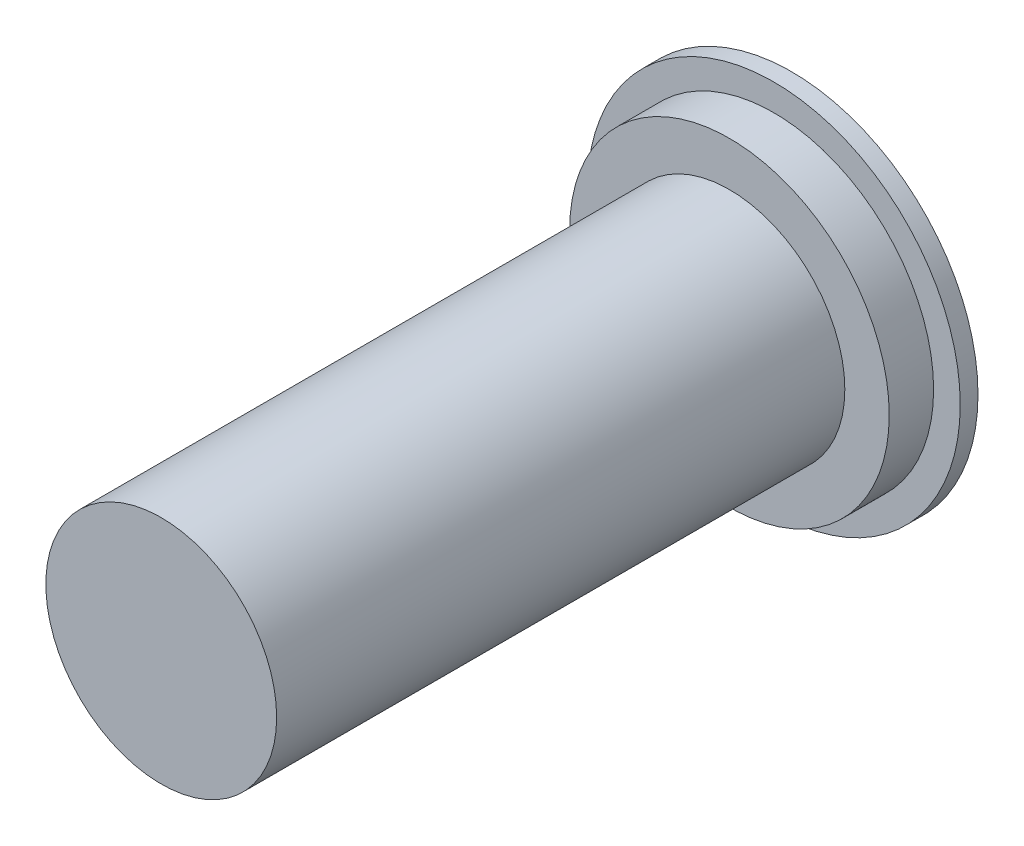
ISO-10303-21;
HEADER;
FILE_DESCRIPTION(('STEP AP214'),'2;1');
FILE_NAME('part.step','',(''),(''),'','','');
FILE_SCHEMA(('AUTOMOTIVE_DESIGN { 1 0 10303 214 1 1 1 1 }'));
ENDSEC;
DATA;
#1=APPLICATION_CONTEXT('core data for automotive mechanical design processes');
#2=APPLICATION_PROTOCOL_DEFINITION('international standard','automotive_design',2000,#1);
#3=PRODUCT_CONTEXT('',#1,'mechanical');
#4=PRODUCT('Part','Part','',(#3));
#5=PRODUCT_RELATED_PRODUCT_CATEGORY('part','',(#4));
#6=PRODUCT_DEFINITION_FORMATION('','',#4);
#7=PRODUCT_DEFINITION_CONTEXT('part definition',#1,'design');
#8=PRODUCT_DEFINITION('design','',#6,#7);
#9=PRODUCT_DEFINITION_SHAPE('','',#8);
#10=(LENGTH_UNIT() NAMED_UNIT(*) SI_UNIT(.MILLI.,.METRE.));
#11=(NAMED_UNIT(*) PLANE_ANGLE_UNIT() SI_UNIT($,.RADIAN.));
#12=(NAMED_UNIT(*) SI_UNIT($,.STERADIAN.) SOLID_ANGLE_UNIT());
#13=UNCERTAINTY_MEASURE_WITH_UNIT(LENGTH_MEASURE(1.E-05),#10,'distance_accuracy_value','');
#14=(GEOMETRIC_REPRESENTATION_CONTEXT(3) GLOBAL_UNCERTAINTY_ASSIGNED_CONTEXT((#13)) GLOBAL_UNIT_ASSIGNED_CONTEXT((#10,
#11,#12)) REPRESENTATION_CONTEXT('',''));
#15=CARTESIAN_POINT('',(0.,0.,0.));
#16=DIRECTION('',(0.,0.,1.));
#17=DIRECTION('',(1.,0.,0.));
#18=AXIS2_PLACEMENT_3D('',#15,#16,#17);
#19=CARTESIAN_POINT('',(0.,0.,70.));
#20=DIRECTION('',(0.,0.,-1.));
#21=DIRECTION('',(-1.,0.,0.));
#22=AXIS2_PLACEMENT_3D('',#19,#20,#21);
#23=CYLINDRICAL_SURFACE('',#22,12.);
#24=CARTESIAN_POINT('',(0.,0.,70.));
#25=DIRECTION('',(0.,0.,1.));
#26=DIRECTION('',(1.,0.,0.));
#27=AXIS2_PLACEMENT_3D('',#24,#25,#26);
#28=CIRCLE('',#27,12.);
#29=CARTESIAN_POINT('',(12.,0.,70.));
#30=VERTEX_POINT('',#29);
#31=EDGE_CURVE('E58',#30,#30,#28,.T.);
#32=ORIENTED_EDGE('',*,*,#31,.T.);
#33=EDGE_LOOP('',(#32));
#34=FACE_BOUND('',#33,.T.);
#35=CARTESIAN_POINT('',(0.,0.,0.));
#36=DIRECTION('',(0.,0.,1.));
#37=DIRECTION('',(1.,0.,0.));
#38=AXIS2_PLACEMENT_3D('',#35,#36,#37);
#39=CIRCLE('',#38,12.);
#40=CARTESIAN_POINT('',(12.,0.,0.));
#41=VERTEX_POINT('',#40);
#42=EDGE_CURVE('E10',#41,#41,#39,.T.);
#43=ORIENTED_EDGE('',*,*,#42,.F.);
#44=EDGE_LOOP('',(#43));
#45=FACE_BOUND('',#44,.T.);
#46=ADVANCED_FACE('F37',(#34,#45),#23,.F.);
#47=CARTESIAN_POINT('',(0.,0.,70.));
#48=DIRECTION('',(0.,0.,-1.));
#49=DIRECTION('',(-1.,0.,0.));
#50=AXIS2_PLACEMENT_3D('',#47,#48,#49);
#51=CYLINDRICAL_SURFACE('',#50,13.);
#52=CARTESIAN_POINT('',(0.,0.,7.));
#53=DIRECTION('',(0.,0.,1.));
#54=DIRECTION('',(1.,0.,0.));
#55=AXIS2_PLACEMENT_3D('',#52,#53,#54);
#56=CIRCLE('',#55,13.);
#57=CARTESIAN_POINT('',(13.,0.,7.));
#58=VERTEX_POINT('',#57);
#59=EDGE_CURVE('E49',#58,#58,#56,.T.);
#60=ORIENTED_EDGE('',*,*,#59,.T.);
#61=EDGE_LOOP('',(#60));
#62=FACE_BOUND('',#61,.T.);
#63=CARTESIAN_POINT('',(0.,0.,71.));
#64=DIRECTION('',(0.,0.,1.));
#65=DIRECTION('',(1.,0.,0.));
#66=AXIS2_PLACEMENT_3D('',#63,#64,#65);
#67=CIRCLE('',#66,13.);
#68=CARTESIAN_POINT('',(13.,0.,71.));
#69=VERTEX_POINT('',#68);
#70=EDGE_CURVE('E62',#69,#69,#67,.T.);
#71=ORIENTED_EDGE('',*,*,#70,.F.);
#72=EDGE_LOOP('',(#71));
#73=FACE_BOUND('',#72,.T.);
#74=ADVANCED_FACE('F93',(#62,#73),#51,.T.);
#75=CARTESIAN_POINT('',(0.,0.,0.));
#76=DIRECTION('',(0.,0.,1.));
#77=DIRECTION('',(1.,0.,0.));
#78=AXIS2_PLACEMENT_3D('',#75,#76,#77);
#79=PLANE('',#78);
#80=ORIENTED_EDGE('',*,*,#42,.T.);
#81=EDGE_LOOP('',(#80));
#82=FACE_BOUND('',#81,.T.);
#83=CARTESIAN_POINT('',(0.,0.,0.));
#84=DIRECTION('',(0.,0.,1.));
#85=DIRECTION('',(1.,0.,0.));
#86=AXIS2_PLACEMENT_3D('',#83,#84,#85);
#87=CIRCLE('',#86,21.);
#88=CARTESIAN_POINT('',(21.,0.,0.));
#89=VERTEX_POINT('',#88);
#90=EDGE_CURVE('E61',#89,#89,#87,.T.);
#91=ORIENTED_EDGE('',*,*,#90,.F.);
#92=EDGE_LOOP('',(#91));
#93=FACE_BOUND('',#92,.T.);
#94=ADVANCED_FACE('F90',(#82,#93),#79,.F.);
#95=CARTESIAN_POINT('',(0.,0.,7.));
#96=DIRECTION('',(0.,0.,-1.));
#97=DIRECTION('',(-1.,0.,0.));
#98=AXIS2_PLACEMENT_3D('',#95,#96,#97);
#99=CYLINDRICAL_SURFACE('',#98,18.);
#100=CARTESIAN_POINT('',(0.,0.,2.));
#101=DIRECTION('',(0.,0.,1.));
#102=DIRECTION('',(1.,0.,0.));
#103=AXIS2_PLACEMENT_3D('',#100,#101,#102);
#104=CIRCLE('',#103,18.);
#105=CARTESIAN_POINT('',(-18.,0.,2.));
#106=VERTEX_POINT('',#105);
#107=EDGE_CURVE('E68',#106,#106,#104,.T.);
#108=CARTESIAN_POINT('',(0.,0.,7.));
#109=DIRECTION('',(0.,0.,1.));
#110=DIRECTION('',(1.,0.,0.));
#111=AXIS2_PLACEMENT_3D('',#108,#109,#110);
#112=CIRCLE('',#111,18.);
#113=CARTESIAN_POINT('',(-18.,0.,7.));
#114=VERTEX_POINT('',#113);
#115=EDGE_CURVE('E44',#114,#114,#112,.T.);
#116=CARTESIAN_POINT('',(-18.,0.,2.));
#117=CARTESIAN_POINT('',(-18.,0.,2.05208333333333));
#118=CARTESIAN_POINT('',(-18.,0.,2.10416666666667));
#119=CARTESIAN_POINT('',(-18.,0.,2.20833333333333));
#120=CARTESIAN_POINT('',(-18.,0.,2.26041666666667));
#121=CARTESIAN_POINT('',(-18.,0.,2.36458333333333));
#122=CARTESIAN_POINT('',(-18.,0.,2.41666666666667));
#123=CARTESIAN_POINT('',(-18.,0.,2.52083333333333));
#124=CARTESIAN_POINT('',(-18.,0.,2.57291666666667));
#125=CARTESIAN_POINT('',(-18.,0.,2.67708333333333));
#126=CARTESIAN_POINT('',(-18.,0.,2.72916666666667));
#127=CARTESIAN_POINT('',(-18.,0.,2.83333333333333));
#128=CARTESIAN_POINT('',(-18.,0.,2.88541666666667));
#129=CARTESIAN_POINT('',(-18.,0.,2.98958333333333));
#130=CARTESIAN_POINT('',(-18.,0.,3.04166666666667));
#131=CARTESIAN_POINT('',(-18.,0.,3.14583333333333));
#132=CARTESIAN_POINT('',(-18.,0.,3.19791666666667));
#133=CARTESIAN_POINT('',(-18.,0.,3.30208333333333));
#134=CARTESIAN_POINT('',(-18.,0.,3.35416666666667));
#135=CARTESIAN_POINT('',(-18.,0.,3.45833333333333));
#136=CARTESIAN_POINT('',(-18.,0.,3.51041666666667));
#137=CARTESIAN_POINT('',(-18.,0.,3.61458333333333));
#138=CARTESIAN_POINT('',(-18.,0.,3.66666666666667));
#139=CARTESIAN_POINT('',(-18.,0.,3.77083333333333));
#140=CARTESIAN_POINT('',(-18.,0.,3.82291666666667));
#141=CARTESIAN_POINT('',(-18.,0.,3.92708333333333));
#142=CARTESIAN_POINT('',(-18.,0.,3.97916666666667));
#143=CARTESIAN_POINT('',(-18.,0.,4.08333333333333));
#144=CARTESIAN_POINT('',(-18.,0.,4.13541666666667));
#145=CARTESIAN_POINT('',(-18.,0.,4.23958333333333));
#146=CARTESIAN_POINT('',(-18.,0.,4.29166666666667));
#147=CARTESIAN_POINT('',(-18.,0.,4.39583333333333));
#148=CARTESIAN_POINT('',(-18.,0.,4.44791666666667));
#149=CARTESIAN_POINT('',(-18.,0.,4.55208333333333));
#150=CARTESIAN_POINT('',(-18.,0.,4.60416666666667));
#151=CARTESIAN_POINT('',(-18.,0.,4.70833333333333));
#152=CARTESIAN_POINT('',(-18.,0.,4.76041666666667));
#153=CARTESIAN_POINT('',(-18.,0.,4.86458333333333));
#154=CARTESIAN_POINT('',(-18.,0.,4.91666666666667));
#155=CARTESIAN_POINT('',(-18.,0.,5.02083333333333));
#156=CARTESIAN_POINT('',(-18.,0.,5.07291666666667));
#157=CARTESIAN_POINT('',(-18.,0.,5.17708333333333));
#158=CARTESIAN_POINT('',(-18.,0.,5.22916666666667));
#159=CARTESIAN_POINT('',(-18.,0.,5.33333333333333));
#160=CARTESIAN_POINT('',(-18.,0.,5.38541666666667));
#161=CARTESIAN_POINT('',(-18.,0.,5.48958333333333));
#162=CARTESIAN_POINT('',(-18.,0.,5.54166666666667));
#163=CARTESIAN_POINT('',(-18.,0.,5.64583333333333));
#164=CARTESIAN_POINT('',(-18.,0.,5.69791666666667));
#165=CARTESIAN_POINT('',(-18.,0.,5.80208333333333));
#166=CARTESIAN_POINT('',(-18.,0.,5.85416666666667));
#167=CARTESIAN_POINT('',(-18.,0.,5.95833333333333));
#168=CARTESIAN_POINT('',(-18.,0.,6.01041666666667));
#169=CARTESIAN_POINT('',(-18.,0.,6.11458333333333));
#170=CARTESIAN_POINT('',(-18.,0.,6.16666666666667));
#171=CARTESIAN_POINT('',(-18.,0.,6.27083333333333));
#172=CARTESIAN_POINT('',(-18.,0.,6.32291666666667));
#173=CARTESIAN_POINT('',(-18.,0.,6.42708333333333));
#174=CARTESIAN_POINT('',(-18.,0.,6.47916666666667));
#175=CARTESIAN_POINT('',(-18.,0.,6.58333333333333));
#176=CARTESIAN_POINT('',(-18.,0.,6.63541666666667));
#177=CARTESIAN_POINT('',(-18.,0.,6.73958333333333));
#178=CARTESIAN_POINT('',(-18.,0.,6.79166666666667));
#179=CARTESIAN_POINT('',(-18.,0.,6.89583333333333));
#180=CARTESIAN_POINT('',(-18.,0.,6.94791666666667));
#181=CARTESIAN_POINT('',(-18.,0.,7.));
#182=B_SPLINE_CURVE_WITH_KNOTS('',3,(#116,#117,#118,#119,#120,#121,#122,#123,#124,#125,#126,
#127,#128,#129,#130,#131,#132,#133,#134,#135,#136,#137,#138,#139,#140,#141,#142,#143,#144,#145,
#146,#147,#148,#149,#150,#151,#152,#153,#154,#155,#156,#157,#158,#159,#160,#161,#162,#163,#164,
#165,#166,#167,#168,#169,#170,#171,#172,#173,#174,#175,#176,#177,#178,#179,#180,#181),
.UNSPECIFIED.,.F.,.F.,(4,2,2,2,2,2,2,2,2,2,2,2,2,2,2,2,2,2,2,2,2,2,2,2,2,2,2,2,2,2,2,2,4),(0.,
0.15625,0.3125,0.46875,0.625000000000001,0.78125,0.9375,1.09375,1.25,1.40625,1.5625,1.71875,
1.875,2.03125,2.1875,2.34375,2.5,2.65625,2.8125,2.96875,3.125,3.28125,3.4375,3.59375,3.75,
3.90625,4.0625,4.21875,4.375,4.53125,4.6875,4.84375,5.),.UNSPECIFIED.);
#183=EDGE_CURVE('BSEAM92',#106,#114,#182,.T.);
#184=ORIENTED_EDGE('',*,*,#107,.T.);
#185=ORIENTED_EDGE('',*,*,#115,.F.);
#186=ORIENTED_EDGE('',*,*,#183,.T.);
#187=ORIENTED_EDGE('',*,*,#183,.F.);
#188=EDGE_LOOP('',(#184,#186,#185,#187));
#189=FACE_BOUND('',#188,.T.);
#190=ADVANCED_FACE('F92',(#189),#99,.T.);
#191=CARTESIAN_POINT('',(0.,0.,7.));
#192=DIRECTION('',(0.,0.,1.));
#193=DIRECTION('',(1.,0.,0.));
#194=AXIS2_PLACEMENT_3D('',#191,#192,#193);
#195=PLANE('',#194);
#196=ORIENTED_EDGE('',*,*,#59,.F.);
#197=EDGE_LOOP('',(#196));
#198=FACE_BOUND('',#197,.T.);
#199=ORIENTED_EDGE('',*,*,#115,.T.);
#200=EDGE_LOOP('',(#199));
#201=FACE_BOUND('',#200,.T.);
#202=ADVANCED_FACE('F86',(#198,#201),#195,.T.);
#203=CARTESIAN_POINT('',(0.,0.,2.));
#204=DIRECTION('',(0.,0.,-1.));
#205=DIRECTION('',(-1.,0.,0.));
#206=AXIS2_PLACEMENT_3D('',#203,#204,#205);
#207=CYLINDRICAL_SURFACE('',#206,21.);
#208=CARTESIAN_POINT('',(0.,0.,2.));
#209=DIRECTION('',(0.,0.,1.));
#210=DIRECTION('',(1.,0.,0.));
#211=AXIS2_PLACEMENT_3D('',#208,#209,#210);
#212=CIRCLE('',#211,21.);
#213=CARTESIAN_POINT('',(21.,0.,2.));
#214=VERTEX_POINT('',#213);
#215=EDGE_CURVE('E55',#214,#214,#212,.T.);
#216=ORIENTED_EDGE('',*,*,#215,.F.);
#217=EDGE_LOOP('',(#216));
#218=FACE_BOUND('',#217,.T.);
#219=ORIENTED_EDGE('',*,*,#90,.T.);
#220=EDGE_LOOP('',(#219));
#221=FACE_BOUND('',#220,.T.);
#222=ADVANCED_FACE('F83',(#218,#221),#207,.T.);
#223=CARTESIAN_POINT('',(0.,0.,2.));
#224=DIRECTION('',(0.,0.,1.));
#225=DIRECTION('',(1.,0.,0.));
#226=AXIS2_PLACEMENT_3D('',#223,#224,#225);
#227=PLANE('',#226);
#228=ORIENTED_EDGE('',*,*,#107,.F.);
#229=EDGE_LOOP('',(#228));
#230=FACE_BOUND('',#229,.T.);
#231=ORIENTED_EDGE('',*,*,#215,.T.);
#232=EDGE_LOOP('',(#231));
#233=FACE_BOUND('',#232,.T.);
#234=ADVANCED_FACE('F81',(#230,#233),#227,.T.);
#235=CARTESIAN_POINT('',(0.,0.,70.));
#236=DIRECTION('',(0.,0.,1.));
#237=DIRECTION('',(1.,0.,0.));
#238=AXIS2_PLACEMENT_3D('',#235,#236,#237);
#239=PLANE('',#238);
#240=ORIENTED_EDGE('',*,*,#31,.F.);
#241=EDGE_LOOP('',(#240));
#242=FACE_BOUND('',#241,.T.);
#243=ADVANCED_FACE('F123',(#242),#239,.F.);
#244=CARTESIAN_POINT('',(0.,0.,71.));
#245=DIRECTION('',(0.,0.,1.));
#246=DIRECTION('',(1.,0.,0.));
#247=AXIS2_PLACEMENT_3D('',#244,#245,#246);
#248=PLANE('',#247);
#249=ORIENTED_EDGE('',*,*,#70,.T.);
#250=EDGE_LOOP('',(#249));
#251=FACE_BOUND('',#250,.T.);
#252=ADVANCED_FACE('F127',(#251),#248,.T.);
#253=CLOSED_SHELL('',(#46,#74,#94,#190,#202,#222,#234,#243,#252));
#254=MANIFOLD_SOLID_BREP('B2',#253);
#255=ADVANCED_BREP_SHAPE_REPRESENTATION('',(#18,#254),#14);
#256=SHAPE_DEFINITION_REPRESENTATION(#9,#255);
ENDSEC;
END-ISO-10303-21;
